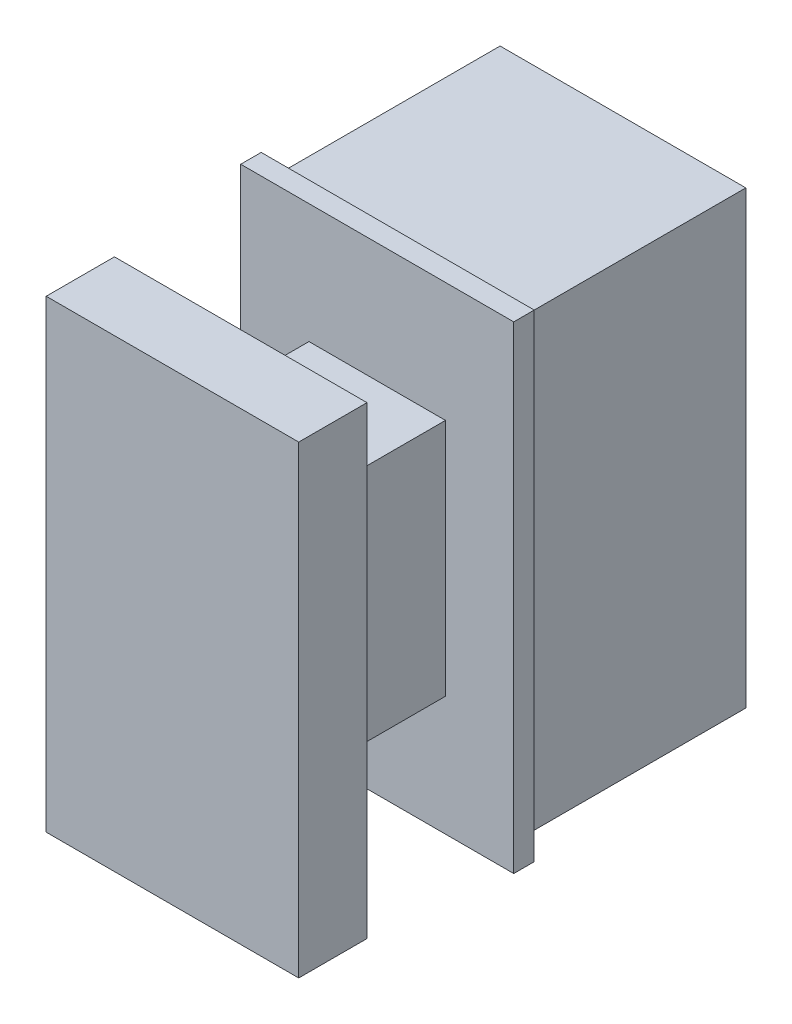
ISO-10303-21;
HEADER;
FILE_DESCRIPTION(('STEP AP214'),'2;1');
FILE_NAME('part.step','',(''),(''),'','','');
FILE_SCHEMA(('AUTOMOTIVE_DESIGN { 1 0 10303 214 1 1 1 1 }'));
ENDSEC;
DATA;
#1=APPLICATION_CONTEXT('core data for automotive mechanical design processes');
#2=APPLICATION_PROTOCOL_DEFINITION('international standard','automotive_design',2000,#1);
#3=PRODUCT_CONTEXT('',#1,'mechanical');
#4=PRODUCT('Part','Part','',(#3));
#5=PRODUCT_RELATED_PRODUCT_CATEGORY('part','',(#4));
#6=PRODUCT_DEFINITION_FORMATION('','',#4);
#7=PRODUCT_DEFINITION_CONTEXT('part definition',#1,'design');
#8=PRODUCT_DEFINITION('design','',#6,#7);
#9=PRODUCT_DEFINITION_SHAPE('','',#8);
#10=(LENGTH_UNIT() NAMED_UNIT(*) SI_UNIT(.MILLI.,.METRE.));
#11=(NAMED_UNIT(*) PLANE_ANGLE_UNIT() SI_UNIT($,.RADIAN.));
#12=(NAMED_UNIT(*) SI_UNIT($,.STERADIAN.) SOLID_ANGLE_UNIT());
#13=UNCERTAINTY_MEASURE_WITH_UNIT(LENGTH_MEASURE(1.E-05),#10,'distance_accuracy_value','');
#14=(GEOMETRIC_REPRESENTATION_CONTEXT(3) GLOBAL_UNCERTAINTY_ASSIGNED_CONTEXT((#13)) GLOBAL_UNIT_ASSIGNED_CONTEXT((#10,
#11,#12)) REPRESENTATION_CONTEXT('',''));
#15=CARTESIAN_POINT('',(0.,0.,0.));
#16=DIRECTION('',(0.,0.,1.));
#17=DIRECTION('',(1.,0.,0.));
#18=AXIS2_PLACEMENT_3D('',#15,#16,#17);
#19=CARTESIAN_POINT('',(0.,0.,0.));
#20=DIRECTION('',(0.,0.,-1.));
#21=DIRECTION('',(-1.,0.,0.));
#22=AXIS2_PLACEMENT_3D('',#19,#20,#21);
#23=PLANE('',#22);
#24=DIRECTION('',(0.,-1.,0.));
#25=VECTOR('',#24,1.);
#26=CARTESIAN_POINT('',(0.,0.,0.));
#27=LINE('',#26,#25);
#28=CARTESIAN_POINT('',(0.,7.,0.));
#29=VERTEX_POINT('',#28);
#30=CARTESIAN_POINT('',(0.,0.,0.));
#31=VERTEX_POINT('',#30);
#32=EDGE_CURVE('E320',#29,#31,#27,.T.);
#33=ORIENTED_EDGE('',*,*,#32,.F.);
#34=DIRECTION('',(-1.,0.,0.));
#35=VECTOR('',#34,1.);
#36=CARTESIAN_POINT('',(0.,7.,0.));
#37=LINE('',#36,#35);
#38=CARTESIAN_POINT('',(4.,7.,0.));
#39=VERTEX_POINT('',#38);
#40=EDGE_CURVE('E335',#39,#29,#37,.T.);
#41=ORIENTED_EDGE('',*,*,#40,.F.);
#42=DIRECTION('',(0.,1.,0.));
#43=VECTOR('',#42,1.);
#44=CARTESIAN_POINT('',(4.,0.,0.));
#45=LINE('',#44,#43);
#46=CARTESIAN_POINT('',(4.,0.,0.));
#47=VERTEX_POINT('',#46);
#48=EDGE_CURVE('E351',#47,#39,#45,.T.);
#49=ORIENTED_EDGE('',*,*,#48,.F.);
#50=DIRECTION('',(1.,0.,0.));
#51=VECTOR('',#50,1.);
#52=CARTESIAN_POINT('',(0.,0.,0.));
#53=LINE('',#52,#51);
#54=EDGE_CURVE('E348',#31,#47,#53,.T.);
#55=ORIENTED_EDGE('',*,*,#54,.F.);
#56=EDGE_LOOP('',(#33,#41,#49,#55));
#57=FACE_BOUND('',#56,.T.);
#58=DIRECTION('',(0.,-1.,0.));
#59=VECTOR('',#58,1.);
#60=CARTESIAN_POINT('',(0.2,6.8,0.));
#61=LINE('',#60,#59);
#62=CARTESIAN_POINT('',(0.2,6.8,0.));
#63=VERTEX_POINT('',#62);
#64=CARTESIAN_POINT('',(0.200000000000001,0.2,0.));
#65=VERTEX_POINT('',#64);
#66=EDGE_CURVE('E292',#63,#65,#61,.T.);
#67=ORIENTED_EDGE('',*,*,#66,.T.);
#68=DIRECTION('',(1.,0.,0.));
#69=VECTOR('',#68,1.);
#70=CARTESIAN_POINT('',(0.200000000000001,0.2,0.));
#71=LINE('',#70,#69);
#72=CARTESIAN_POINT('',(3.8,0.2,0.));
#73=VERTEX_POINT('',#72);
#74=EDGE_CURVE('E278',#65,#73,#71,.T.);
#75=ORIENTED_EDGE('',*,*,#74,.T.);
#76=DIRECTION('',(0.,-1.,0.));
#77=VECTOR('',#76,1.);
#78=CARTESIAN_POINT('',(3.8,6.8,0.));
#79=LINE('',#78,#77);
#80=CARTESIAN_POINT('',(3.8,6.8,0.));
#81=VERTEX_POINT('',#80);
#82=EDGE_CURVE('E306',#81,#73,#79,.T.);
#83=ORIENTED_EDGE('',*,*,#82,.F.);
#84=DIRECTION('',(1.,0.,0.));
#85=VECTOR('',#84,1.);
#86=CARTESIAN_POINT('',(0.2,6.8,0.));
#87=LINE('',#86,#85);
#88=EDGE_CURVE('E310',#63,#81,#87,.T.);
#89=ORIENTED_EDGE('',*,*,#88,.F.);
#90=EDGE_LOOP('',(#67,#75,#83,#89));
#91=FACE_BOUND('',#90,.T.);
#92=ADVANCED_FACE('F43',(#57,#91),#23,.T.);
#93=CARTESIAN_POINT('',(0.,0.,0.3));
#94=DIRECTION('',(1.,0.,0.));
#95=DIRECTION('',(0.,0.,-1.));
#96=AXIS2_PLACEMENT_3D('',#93,#94,#95);
#97=PLANE('',#96);
#98=ORIENTED_EDGE('',*,*,#32,.T.);
#99=DIRECTION('',(0.,0.,-1.));
#100=VECTOR('',#99,1.);
#101=CARTESIAN_POINT('',(0.,0.,0.3));
#102=LINE('',#101,#100);
#103=CARTESIAN_POINT('',(0.,0.,0.3));
#104=VERTEX_POINT('',#103);
#105=EDGE_CURVE('E367',#104,#31,#102,.T.);
#106=ORIENTED_EDGE('',*,*,#105,.F.);
#107=DIRECTION('',(0.,-1.,0.));
#108=VECTOR('',#107,1.);
#109=CARTESIAN_POINT('',(0.,0.,0.3));
#110=LINE('',#109,#108);
#111=CARTESIAN_POINT('',(0.,7.,0.3));
#112=VERTEX_POINT('',#111);
#113=EDGE_CURVE('E330',#112,#104,#110,.T.);
#114=ORIENTED_EDGE('',*,*,#113,.F.);
#115=DIRECTION('',(0.,0.,-1.));
#116=VECTOR('',#115,1.);
#117=CARTESIAN_POINT('',(0.,7.,0.3));
#118=LINE('',#117,#116);
#119=EDGE_CURVE('E344',#112,#29,#118,.T.);
#120=ORIENTED_EDGE('',*,*,#119,.T.);
#121=EDGE_LOOP('',(#98,#106,#114,#120));
#122=FACE_BOUND('',#121,.T.);
#123=ADVANCED_FACE('F45',(#122),#97,.F.);
#124=CARTESIAN_POINT('',(0.,0.,0.3));
#125=DIRECTION('',(0.,1.,0.));
#126=DIRECTION('',(0.,0.,1.));
#127=AXIS2_PLACEMENT_3D('',#124,#125,#126);
#128=PLANE('',#127);
#129=ORIENTED_EDGE('',*,*,#54,.T.);
#130=DIRECTION('',(0.,0.,-1.));
#131=VECTOR('',#130,1.);
#132=CARTESIAN_POINT('',(4.,0.,0.3));
#133=LINE('',#132,#131);
#134=CARTESIAN_POINT('',(4.,0.,0.3));
#135=VERTEX_POINT('',#134);
#136=EDGE_CURVE('E363',#135,#47,#133,.T.);
#137=ORIENTED_EDGE('',*,*,#136,.F.);
#138=DIRECTION('',(1.,0.,0.));
#139=VECTOR('',#138,1.);
#140=CARTESIAN_POINT('',(0.,0.,0.3));
#141=LINE('',#140,#139);
#142=EDGE_CURVE('E334',#104,#135,#141,.T.);
#143=ORIENTED_EDGE('',*,*,#142,.F.);
#144=ORIENTED_EDGE('',*,*,#105,.T.);
#145=EDGE_LOOP('',(#129,#137,#143,#144));
#146=FACE_BOUND('',#145,.T.);
#147=ADVANCED_FACE('F407',(#146),#128,.F.);
#148=CARTESIAN_POINT('',(4.,0.,0.3));
#149=DIRECTION('',(-1.,0.,0.));
#150=DIRECTION('',(0.,0.,1.));
#151=AXIS2_PLACEMENT_3D('',#148,#149,#150);
#152=PLANE('',#151);
#153=ORIENTED_EDGE('',*,*,#48,.T.);
#154=DIRECTION('',(0.,0.,-1.));
#155=VECTOR('',#154,1.);
#156=CARTESIAN_POINT('',(4.,7.,0.3));
#157=LINE('',#156,#155);
#158=CARTESIAN_POINT('',(4.,7.,0.3));
#159=VERTEX_POINT('',#158);
#160=EDGE_CURVE('E359',#159,#39,#157,.T.);
#161=ORIENTED_EDGE('',*,*,#160,.F.);
#162=DIRECTION('',(0.,1.,0.));
#163=VECTOR('',#162,1.);
#164=CARTESIAN_POINT('',(4.,0.,0.3));
#165=LINE('',#164,#163);
#166=EDGE_CURVE('E338',#135,#159,#165,.T.);
#167=ORIENTED_EDGE('',*,*,#166,.F.);
#168=ORIENTED_EDGE('',*,*,#136,.T.);
#169=EDGE_LOOP('',(#153,#161,#167,#168));
#170=FACE_BOUND('',#169,.T.);
#171=ADVANCED_FACE('F412',(#170),#152,.F.);
#172=CARTESIAN_POINT('',(0.,7.,0.3));
#173=DIRECTION('',(0.,-1.,0.));
#174=DIRECTION('',(0.,0.,-1.));
#175=AXIS2_PLACEMENT_3D('',#172,#173,#174);
#176=PLANE('',#175);
#177=ORIENTED_EDGE('',*,*,#40,.T.);
#178=ORIENTED_EDGE('',*,*,#119,.F.);
#179=DIRECTION('',(-1.,0.,0.));
#180=VECTOR('',#179,1.);
#181=CARTESIAN_POINT('',(0.,7.,0.3));
#182=LINE('',#181,#180);
#183=EDGE_CURVE('E341',#159,#112,#182,.T.);
#184=ORIENTED_EDGE('',*,*,#183,.F.);
#185=ORIENTED_EDGE('',*,*,#160,.T.);
#186=EDGE_LOOP('',(#177,#178,#184,#185));
#187=FACE_BOUND('',#186,.T.);
#188=ADVANCED_FACE('F397',(#187),#176,.F.);
#189=CARTESIAN_POINT('',(0.,0.,0.3));
#190=DIRECTION('',(0.,0.,-1.));
#191=DIRECTION('',(-1.,0.,0.));
#192=AXIS2_PLACEMENT_3D('',#189,#190,#191);
#193=PLANE('',#192);
#194=DIRECTION('',(0.,1.,0.));
#195=VECTOR('',#194,1.);
#196=CARTESIAN_POINT('',(1.,0.,0.3));
#197=LINE('',#196,#195);
#198=CARTESIAN_POINT('',(1.,1.75,0.3));
#199=VERTEX_POINT('',#198);
#200=CARTESIAN_POINT('',(1.,5.25,0.3));
#201=VERTEX_POINT('',#200);
#202=EDGE_CURVE('E52',#199,#201,#197,.T.);
#203=ORIENTED_EDGE('',*,*,#202,.T.);
#204=DIRECTION('',(1.,0.,0.));
#205=VECTOR('',#204,1.);
#206=CARTESIAN_POINT('',(0.,5.25,0.3));
#207=LINE('',#206,#205);
#208=CARTESIAN_POINT('',(3.,5.25,0.3));
#209=VERTEX_POINT('',#208);
#210=EDGE_CURVE('E11',#201,#209,#207,.T.);
#211=ORIENTED_EDGE('',*,*,#210,.T.);
#212=DIRECTION('',(0.,1.,0.));
#213=VECTOR('',#212,1.);
#214=CARTESIAN_POINT('',(3.,0.,0.3));
#215=LINE('',#214,#213);
#216=CARTESIAN_POINT('',(3.,1.75,0.3));
#217=VERTEX_POINT('',#216);
#218=EDGE_CURVE('E371',#217,#209,#215,.T.);
#219=ORIENTED_EDGE('',*,*,#218,.F.);
#220=DIRECTION('',(1.,0.,0.));
#221=VECTOR('',#220,1.);
#222=CARTESIAN_POINT('',(0.,1.75,0.3));
#223=LINE('',#222,#221);
#224=EDGE_CURVE('E62',#199,#217,#223,.T.);
#225=ORIENTED_EDGE('',*,*,#224,.F.);
#226=EDGE_LOOP('',(#203,#211,#219,#225));
#227=FACE_BOUND('',#226,.T.);
#228=ORIENTED_EDGE('',*,*,#113,.T.);
#229=ORIENTED_EDGE('',*,*,#142,.T.);
#230=ORIENTED_EDGE('',*,*,#166,.T.);
#231=ORIENTED_EDGE('',*,*,#183,.T.);
#232=EDGE_LOOP('',(#228,#229,#230,#231));
#233=FACE_BOUND('',#232,.T.);
#234=ADVANCED_FACE('F393',(#227,#233),#193,.F.);
#235=CARTESIAN_POINT('',(0.200000000000001,0.2,-3.3));
#236=DIRECTION('',(0.,-1.,0.));
#237=DIRECTION('',(0.,0.,-1.));
#238=AXIS2_PLACEMENT_3D('',#235,#236,#237);
#239=PLANE('',#238);
#240=ORIENTED_EDGE('',*,*,#74,.F.);
#241=DIRECTION('',(0.,0.,1.));
#242=VECTOR('',#241,1.);
#243=CARTESIAN_POINT('',(0.200000000000001,0.2,-3.3));
#244=LINE('',#243,#242);
#245=CARTESIAN_POINT('',(0.200000000000001,0.2,-3.3));
#246=VERTEX_POINT('',#245);
#247=EDGE_CURVE('E316',#246,#65,#244,.T.);
#248=ORIENTED_EDGE('',*,*,#247,.F.);
#249=DIRECTION('',(1.,0.,0.));
#250=VECTOR('',#249,1.);
#251=CARTESIAN_POINT('',(0.200000000000001,0.2,-3.3));
#252=LINE('',#251,#250);
#253=CARTESIAN_POINT('',(3.8,0.2,-3.3));
#254=VERTEX_POINT('',#253);
#255=EDGE_CURVE('E287',#246,#254,#252,.T.);
#256=ORIENTED_EDGE('',*,*,#255,.T.);
#257=DIRECTION('',(0.,0.,1.));
#258=VECTOR('',#257,1.);
#259=CARTESIAN_POINT('',(3.8,0.2,-3.3));
#260=LINE('',#259,#258);
#261=EDGE_CURVE('E302',#254,#73,#260,.T.);
#262=ORIENTED_EDGE('',*,*,#261,.T.);
#263=EDGE_LOOP('',(#240,#248,#256,#262));
#264=FACE_BOUND('',#263,.T.);
#265=ADVANCED_FACE('F396',(#264),#239,.T.);
#266=CARTESIAN_POINT('',(0.2,6.8,-3.3));
#267=DIRECTION('',(-1.,0.,0.));
#268=DIRECTION('',(0.,-1.,0.));
#269=AXIS2_PLACEMENT_3D('',#266,#267,#268);
#270=PLANE('',#269);
#271=ORIENTED_EDGE('',*,*,#66,.F.);
#272=DIRECTION('',(0.,0.,1.));
#273=VECTOR('',#272,1.);
#274=CARTESIAN_POINT('',(0.2,6.8,-3.3));
#275=LINE('',#274,#273);
#276=CARTESIAN_POINT('',(0.2,6.8,-3.3));
#277=VERTEX_POINT('',#276);
#278=EDGE_CURVE('E321',#277,#63,#275,.T.);
#279=ORIENTED_EDGE('',*,*,#278,.F.);
#280=DIRECTION('',(0.,-1.,0.));
#281=VECTOR('',#280,1.);
#282=CARTESIAN_POINT('',(0.2,6.8,-3.3));
#283=LINE('',#282,#281);
#284=EDGE_CURVE('E298',#277,#246,#283,.T.);
#285=ORIENTED_EDGE('',*,*,#284,.T.);
#286=ORIENTED_EDGE('',*,*,#247,.T.);
#287=EDGE_LOOP('',(#271,#279,#285,#286));
#288=FACE_BOUND('',#287,.T.);
#289=ADVANCED_FACE('F423',(#288),#270,.T.);
#290=CARTESIAN_POINT('',(0.2,6.8,-3.3));
#291=DIRECTION('',(0.,-1.,0.));
#292=DIRECTION('',(0.,0.,-1.));
#293=AXIS2_PLACEMENT_3D('',#290,#291,#292);
#294=PLANE('',#293);
#295=ORIENTED_EDGE('',*,*,#88,.T.);
#296=DIRECTION('',(0.,0.,1.));
#297=VECTOR('',#296,1.);
#298=CARTESIAN_POINT('',(3.8,6.8,-3.3));
#299=LINE('',#298,#297);
#300=CARTESIAN_POINT('',(3.8,6.8,-3.3));
#301=VERTEX_POINT('',#300);
#302=EDGE_CURVE('E324',#301,#81,#299,.T.);
#303=ORIENTED_EDGE('',*,*,#302,.F.);
#304=DIRECTION('',(1.,0.,0.));
#305=VECTOR('',#304,1.);
#306=CARTESIAN_POINT('',(0.2,6.8,-3.3));
#307=LINE('',#306,#305);
#308=EDGE_CURVE('E295',#277,#301,#307,.T.);
#309=ORIENTED_EDGE('',*,*,#308,.F.);
#310=ORIENTED_EDGE('',*,*,#278,.T.);
#311=EDGE_LOOP('',(#295,#303,#309,#310));
#312=FACE_BOUND('',#311,.T.);
#313=ADVANCED_FACE('F436',(#312),#294,.F.);
#314=CARTESIAN_POINT('',(3.8,6.8,-3.3));
#315=DIRECTION('',(-1.,0.,0.));
#316=DIRECTION('',(0.,-1.,0.));
#317=AXIS2_PLACEMENT_3D('',#314,#315,#316);
#318=PLANE('',#317);
#319=ORIENTED_EDGE('',*,*,#82,.T.);
#320=ORIENTED_EDGE('',*,*,#261,.F.);
#321=DIRECTION('',(0.,-1.,0.));
#322=VECTOR('',#321,1.);
#323=CARTESIAN_POINT('',(3.8,6.8,-3.3));
#324=LINE('',#323,#322);
#325=EDGE_CURVE('E291',#301,#254,#324,.T.);
#326=ORIENTED_EDGE('',*,*,#325,.F.);
#327=ORIENTED_EDGE('',*,*,#302,.T.);
#328=EDGE_LOOP('',(#319,#320,#326,#327));
#329=FACE_BOUND('',#328,.T.);
#330=ADVANCED_FACE('F434',(#329),#318,.F.);
#331=CARTESIAN_POINT('',(0.,0.,-3.3));
#332=DIRECTION('',(0.,0.,-1.));
#333=DIRECTION('',(-1.,0.,0.));
#334=AXIS2_PLACEMENT_3D('',#331,#332,#333);
#335=PLANE('',#334);
#336=DIRECTION('',(0.,1.,0.));
#337=VECTOR('',#336,1.);
#338=CARTESIAN_POINT('',(3.6,6.6,-3.3));
#339=LINE('',#338,#337);
#340=CARTESIAN_POINT('',(3.6,0.4,-3.3));
#341=VERTEX_POINT('',#340);
#342=CARTESIAN_POINT('',(3.6,6.6,-3.3));
#343=VERTEX_POINT('',#342);
#344=EDGE_CURVE('E243',#341,#343,#339,.T.);
#345=ORIENTED_EDGE('',*,*,#344,.T.);
#346=DIRECTION('',(-1.,0.,0.));
#347=VECTOR('',#346,1.);
#348=CARTESIAN_POINT('',(3.6,6.6,-3.3));
#349=LINE('',#348,#347);
#350=CARTESIAN_POINT('',(0.4,6.6,-3.3));
#351=VERTEX_POINT('',#350);
#352=EDGE_CURVE('E247',#343,#351,#349,.T.);
#353=ORIENTED_EDGE('',*,*,#352,.T.);
#354=DIRECTION('',(0.,-1.,0.));
#355=VECTOR('',#354,1.);
#356=CARTESIAN_POINT('',(0.4,6.6,-3.3));
#357=LINE('',#356,#355);
#358=CARTESIAN_POINT('',(0.400000000000001,0.4,-3.3));
#359=VERTEX_POINT('',#358);
#360=EDGE_CURVE('E252',#351,#359,#357,.T.);
#361=ORIENTED_EDGE('',*,*,#360,.T.);
#362=DIRECTION('',(1.,0.,0.));
#363=VECTOR('',#362,1.);
#364=CARTESIAN_POINT('',(3.6,0.4,-3.3));
#365=LINE('',#364,#363);
#366=EDGE_CURVE('E256',#359,#341,#365,.T.);
#367=ORIENTED_EDGE('',*,*,#366,.T.);
#368=EDGE_LOOP('',(#345,#353,#361,#367));
#369=FACE_BOUND('',#368,.T.);
#370=ORIENTED_EDGE('',*,*,#255,.F.);
#371=ORIENTED_EDGE('',*,*,#284,.F.);
#372=ORIENTED_EDGE('',*,*,#308,.T.);
#373=ORIENTED_EDGE('',*,*,#325,.T.);
#374=EDGE_LOOP('',(#370,#371,#372,#373));
#375=FACE_BOUND('',#374,.T.);
#376=ADVANCED_FACE('F429',(#369,#375),#335,.T.);
#377=CARTESIAN_POINT('',(3.6,6.6,-3.3));
#378=DIRECTION('',(1.,0.,0.));
#379=DIRECTION('',(0.,1.,0.));
#380=AXIS2_PLACEMENT_3D('',#377,#378,#379);
#381=PLANE('',#380);
#382=DIRECTION('',(0.,1.,0.));
#383=VECTOR('',#382,1.);
#384=CARTESIAN_POINT('',(3.6,6.6,0.));
#385=LINE('',#384,#383);
#386=CARTESIAN_POINT('',(3.6,0.4,0.));
#387=VERTEX_POINT('',#386);
#388=CARTESIAN_POINT('',(3.6,6.6,0.));
#389=VERTEX_POINT('',#388);
#390=EDGE_CURVE('E231',#387,#389,#385,.T.);
#391=ORIENTED_EDGE('',*,*,#390,.T.);
#392=DIRECTION('',(0.,0.,1.));
#393=VECTOR('',#392,1.);
#394=CARTESIAN_POINT('',(3.6,6.6,-3.3));
#395=LINE('',#394,#393);
#396=EDGE_CURVE('E260',#343,#389,#395,.T.);
#397=ORIENTED_EDGE('',*,*,#396,.F.);
#398=ORIENTED_EDGE('',*,*,#344,.F.);
#399=DIRECTION('',(0.,0.,1.));
#400=VECTOR('',#399,1.);
#401=CARTESIAN_POINT('',(3.6,0.4,-3.3));
#402=LINE('',#401,#400);
#403=EDGE_CURVE('E275',#341,#387,#402,.T.);
#404=ORIENTED_EDGE('',*,*,#403,.T.);
#405=EDGE_LOOP('',(#391,#397,#398,#404));
#406=FACE_BOUND('',#405,.T.);
#407=ADVANCED_FACE('F502',(#406),#381,.F.);
#408=CARTESIAN_POINT('',(3.6,0.4,-3.3));
#409=DIRECTION('',(0.,-1.,0.));
#410=DIRECTION('',(1.,0.,0.));
#411=AXIS2_PLACEMENT_3D('',#408,#409,#410);
#412=PLANE('',#411);
#413=DIRECTION('',(1.,0.,0.));
#414=VECTOR('',#413,1.);
#415=CARTESIAN_POINT('',(3.6,0.4,0.));
#416=LINE('',#415,#414);
#417=CARTESIAN_POINT('',(0.400000000000001,0.4,0.));
#418=VERTEX_POINT('',#417);
#419=EDGE_CURVE('E248',#418,#387,#416,.T.);
#420=ORIENTED_EDGE('',*,*,#419,.T.);
#421=ORIENTED_EDGE('',*,*,#403,.F.);
#422=ORIENTED_EDGE('',*,*,#366,.F.);
#423=DIRECTION('',(0.,0.,1.));
#424=VECTOR('',#423,1.);
#425=CARTESIAN_POINT('',(0.400000000000001,0.4,-3.3));
#426=LINE('',#425,#424);
#427=EDGE_CURVE('E279',#359,#418,#426,.T.);
#428=ORIENTED_EDGE('',*,*,#427,.T.);
#429=EDGE_LOOP('',(#420,#421,#422,#428));
#430=FACE_BOUND('',#429,.T.);
#431=ADVANCED_FACE('F512',(#430),#412,.F.);
#432=CARTESIAN_POINT('',(0.4,6.6,-3.3));
#433=DIRECTION('',(-1.,0.,0.));
#434=DIRECTION('',(0.,-1.,0.));
#435=AXIS2_PLACEMENT_3D('',#432,#433,#434);
#436=PLANE('',#435);
#437=DIRECTION('',(0.,-1.,0.));
#438=VECTOR('',#437,1.);
#439=CARTESIAN_POINT('',(0.4,6.6,0.));
#440=LINE('',#439,#438);
#441=CARTESIAN_POINT('',(0.4,6.6,0.));
#442=VERTEX_POINT('',#441);
#443=EDGE_CURVE('E268',#442,#418,#440,.T.);
#444=ORIENTED_EDGE('',*,*,#443,.T.);
#445=ORIENTED_EDGE('',*,*,#427,.F.);
#446=ORIENTED_EDGE('',*,*,#360,.F.);
#447=DIRECTION('',(0.,0.,1.));
#448=VECTOR('',#447,1.);
#449=CARTESIAN_POINT('',(0.4,6.6,-3.3));
#450=LINE('',#449,#448);
#451=EDGE_CURVE('E282',#351,#442,#450,.T.);
#452=ORIENTED_EDGE('',*,*,#451,.T.);
#453=EDGE_LOOP('',(#444,#445,#446,#452));
#454=FACE_BOUND('',#453,.T.);
#455=ADVANCED_FACE('F523',(#454),#436,.F.);
#456=CARTESIAN_POINT('',(3.6,6.6,-3.3));
#457=DIRECTION('',(0.,1.,0.));
#458=DIRECTION('',(0.,0.,1.));
#459=AXIS2_PLACEMENT_3D('',#456,#457,#458);
#460=PLANE('',#459);
#461=DIRECTION('',(-1.,0.,0.));
#462=VECTOR('',#461,1.);
#463=CARTESIAN_POINT('',(3.6,6.6,0.));
#464=LINE('',#463,#462);
#465=EDGE_CURVE('E264',#389,#442,#464,.T.);
#466=ORIENTED_EDGE('',*,*,#465,.T.);
#467=ORIENTED_EDGE('',*,*,#451,.F.);
#468=ORIENTED_EDGE('',*,*,#352,.F.);
#469=ORIENTED_EDGE('',*,*,#396,.T.);
#470=EDGE_LOOP('',(#466,#467,#468,#469));
#471=FACE_BOUND('',#470,.T.);
#472=ADVANCED_FACE('F534',(#471),#460,.F.);
#473=CARTESIAN_POINT('',(0.,0.,0.));
#474=DIRECTION('',(0.,0.,-1.));
#475=DIRECTION('',(-1.,0.,0.));
#476=AXIS2_PLACEMENT_3D('',#473,#474,#475);
#477=PLANE('',#476);
#478=ORIENTED_EDGE('',*,*,#390,.F.);
#479=ORIENTED_EDGE('',*,*,#419,.F.);
#480=ORIENTED_EDGE('',*,*,#443,.F.);
#481=ORIENTED_EDGE('',*,*,#465,.F.);
#482=EDGE_LOOP('',(#478,#479,#480,#481));
#483=FACE_BOUND('',#482,.T.);
#484=ADVANCED_FACE('F545',(#483),#477,.T.);
#485=CARTESIAN_POINT('',(1.,5.25,2.3));
#486=DIRECTION('',(0.,1.,0.));
#487=DIRECTION('',(0.,0.,1.));
#488=AXIS2_PLACEMENT_3D('',#485,#486,#487);
#489=PLANE('',#488);
#490=ORIENTED_EDGE('',*,*,#210,.F.);
#491=DIRECTION('',(0.,0.,-1.));
#492=VECTOR('',#491,1.);
#493=CARTESIAN_POINT('',(1.,5.25,2.3));
#494=LINE('',#493,#492);
#495=CARTESIAN_POINT('',(1.,5.25,2.3));
#496=VERTEX_POINT('',#495);
#497=EDGE_CURVE('E227',#496,#201,#494,.T.);
#498=ORIENTED_EDGE('',*,*,#497,.F.);
#499=DIRECTION('',(1.,0.,0.));
#500=VECTOR('',#499,1.);
#501=CARTESIAN_POINT('',(1.,5.25,2.3));
#502=LINE('',#501,#500);
#503=CARTESIAN_POINT('',(3.,5.25,2.3));
#504=VERTEX_POINT('',#503);
#505=EDGE_CURVE('E205',#496,#504,#502,.T.);
#506=ORIENTED_EDGE('',*,*,#505,.T.);
#507=DIRECTION('',(0.,0.,-1.));
#508=VECTOR('',#507,1.);
#509=CARTESIAN_POINT('',(3.,5.25,2.3));
#510=LINE('',#509,#508);
#511=EDGE_CURVE('E226',#504,#209,#510,.T.);
#512=ORIENTED_EDGE('',*,*,#511,.T.);
#513=EDGE_LOOP('',(#490,#498,#506,#512));
#514=FACE_BOUND('',#513,.T.);
#515=ADVANCED_FACE('F392',(#514),#489,.T.);
#516=CARTESIAN_POINT('',(1.,1.75,2.3));
#517=DIRECTION('',(-1.,0.,0.));
#518=DIRECTION('',(0.,0.,1.));
#519=AXIS2_PLACEMENT_3D('',#516,#517,#518);
#520=PLANE('',#519);
#521=ORIENTED_EDGE('',*,*,#202,.F.);
#522=DIRECTION('',(0.,0.,-1.));
#523=VECTOR('',#522,1.);
#524=CARTESIAN_POINT('',(1.,1.75,2.3));
#525=LINE('',#524,#523);
#526=CARTESIAN_POINT('',(1.,1.75,2.3));
#527=VERTEX_POINT('',#526);
#528=EDGE_CURVE('E232',#527,#199,#525,.T.);
#529=ORIENTED_EDGE('',*,*,#528,.F.);
#530=DIRECTION('',(0.,1.,0.));
#531=VECTOR('',#530,1.);
#532=CARTESIAN_POINT('',(1.,1.75,2.3));
#533=LINE('',#532,#531);
#534=EDGE_CURVE('E222',#527,#496,#533,.T.);
#535=ORIENTED_EDGE('',*,*,#534,.T.);
#536=ORIENTED_EDGE('',*,*,#497,.T.);
#537=EDGE_LOOP('',(#521,#529,#535,#536));
#538=FACE_BOUND('',#537,.T.);
#539=ADVANCED_FACE('F390',(#538),#520,.T.);
#540=CARTESIAN_POINT('',(1.,1.75,2.3));
#541=DIRECTION('',(0.,1.,0.));
#542=DIRECTION('',(0.,0.,1.));
#543=AXIS2_PLACEMENT_3D('',#540,#541,#542);
#544=PLANE('',#543);
#545=ORIENTED_EDGE('',*,*,#528,.T.);
#546=ORIENTED_EDGE('',*,*,#224,.T.);
#547=DIRECTION('',(0.,0.,-1.));
#548=VECTOR('',#547,1.);
#549=CARTESIAN_POINT('',(3.,1.75,2.3));
#550=LINE('',#549,#548);
#551=CARTESIAN_POINT('',(3.,1.75,2.3));
#552=VERTEX_POINT('',#551);
#553=EDGE_CURVE('E236',#552,#217,#550,.T.);
#554=ORIENTED_EDGE('',*,*,#553,.F.);
#555=DIRECTION('',(1.,0.,0.));
#556=VECTOR('',#555,1.);
#557=CARTESIAN_POINT('',(1.,1.75,2.3));
#558=LINE('',#557,#556);
#559=EDGE_CURVE('E218',#527,#552,#558,.T.);
#560=ORIENTED_EDGE('',*,*,#559,.F.);
#561=EDGE_LOOP('',(#545,#546,#554,#560));
#562=FACE_BOUND('',#561,.T.);
#563=ADVANCED_FACE('F378',(#562),#544,.F.);
#564=CARTESIAN_POINT('',(3.,1.75,2.3));
#565=DIRECTION('',(-1.,0.,0.));
#566=DIRECTION('',(0.,0.,1.));
#567=AXIS2_PLACEMENT_3D('',#564,#565,#566);
#568=PLANE('',#567);
#569=ORIENTED_EDGE('',*,*,#553,.T.);
#570=ORIENTED_EDGE('',*,*,#218,.T.);
#571=ORIENTED_EDGE('',*,*,#511,.F.);
#572=DIRECTION('',(0.,1.,0.));
#573=VECTOR('',#572,1.);
#574=CARTESIAN_POINT('',(3.,1.75,2.3));
#575=LINE('',#574,#573);
#576=EDGE_CURVE('E209',#552,#504,#575,.T.);
#577=ORIENTED_EDGE('',*,*,#576,.F.);
#578=EDGE_LOOP('',(#569,#570,#571,#577));
#579=FACE_BOUND('',#578,.T.);
#580=ADVANCED_FACE('F382',(#579),#568,.F.);
#581=CARTESIAN_POINT('',(3.85,6.9,3.3));
#582=DIRECTION('',(-1.,0.,0.));
#583=DIRECTION('',(0.,-1.,0.));
#584=AXIS2_PLACEMENT_3D('',#581,#582,#583);
#585=PLANE('',#584);
#586=DIRECTION('',(0.,1.,0.));
#587=VECTOR('',#586,1.);
#588=CARTESIAN_POINT('',(3.85,6.9,2.3));
#589=LINE('',#588,#587);
#590=CARTESIAN_POINT('',(3.85,0.0999999999999998,2.3));
#591=VERTEX_POINT('',#590);
#592=CARTESIAN_POINT('',(3.85,6.9,2.3));
#593=VERTEX_POINT('',#592);
#594=EDGE_CURVE('E203',#591,#593,#589,.T.);
#595=ORIENTED_EDGE('',*,*,#594,.T.);
#596=DIRECTION('',(0.,0.,-1.));
#597=VECTOR('',#596,1.);
#598=CARTESIAN_POINT('',(3.85,6.9,3.3));
#599=LINE('',#598,#597);
#600=CARTESIAN_POINT('',(3.85,6.9,3.3));
#601=VERTEX_POINT('',#600);
#602=EDGE_CURVE('E181',#601,#593,#599,.T.);
#603=ORIENTED_EDGE('',*,*,#602,.F.);
#604=DIRECTION('',(0.,1.,0.));
#605=VECTOR('',#604,1.);
#606=CARTESIAN_POINT('',(3.85,6.9,3.3));
#607=LINE('',#606,#605);
#608=CARTESIAN_POINT('',(3.85,0.0999999999999998,3.3));
#609=VERTEX_POINT('',#608);
#610=EDGE_CURVE('E189',#609,#601,#607,.T.);
#611=ORIENTED_EDGE('',*,*,#610,.F.);
#612=DIRECTION('',(0.,0.,-1.));
#613=VECTOR('',#612,1.);
#614=CARTESIAN_POINT('',(3.85,0.0999999999999998,3.3));
#615=LINE('',#614,#613);
#616=EDGE_CURVE('E683',#609,#591,#615,.T.);
#617=ORIENTED_EDGE('',*,*,#616,.T.);
#618=EDGE_LOOP('',(#595,#603,#611,#617));
#619=FACE_BOUND('',#618,.T.);
#620=ADVANCED_FACE('F201',(#619),#585,.F.);
#621=CARTESIAN_POINT('',(0.15,6.9,3.3));
#622=DIRECTION('',(0.,-1.,0.));
#623=DIRECTION('',(0.,0.,-1.));
#624=AXIS2_PLACEMENT_3D('',#621,#622,#623);
#625=PLANE('',#624);
#626=DIRECTION('',(-1.,0.,0.));
#627=VECTOR('',#626,1.);
#628=CARTESIAN_POINT('',(0.15,6.9,2.3));
#629=LINE('',#628,#627);
#630=CARTESIAN_POINT('',(0.15,6.9,2.3));
#631=VERTEX_POINT('',#630);
#632=EDGE_CURVE('E691',#593,#631,#629,.T.);
#633=ORIENTED_EDGE('',*,*,#632,.T.);
#634=DIRECTION('',(0.,0.,-1.));
#635=VECTOR('',#634,1.);
#636=CARTESIAN_POINT('',(0.15,6.9,3.3));
#637=LINE('',#636,#635);
#638=CARTESIAN_POINT('',(0.15,6.9,3.3));
#639=VERTEX_POINT('',#638);
#640=EDGE_CURVE('E184',#639,#631,#637,.T.);
#641=ORIENTED_EDGE('',*,*,#640,.F.);
#642=DIRECTION('',(-1.,0.,0.));
#643=VECTOR('',#642,1.);
#644=CARTESIAN_POINT('',(0.15,6.9,3.3));
#645=LINE('',#644,#643);
#646=EDGE_CURVE('E177',#601,#639,#645,.T.);
#647=ORIENTED_EDGE('',*,*,#646,.F.);
#648=ORIENTED_EDGE('',*,*,#602,.T.);
#649=EDGE_LOOP('',(#633,#641,#647,#648));
#650=FACE_BOUND('',#649,.T.);
#651=ADVANCED_FACE('F179',(#650),#625,.F.);
#652=CARTESIAN_POINT('',(0.15,6.9,3.3));
#653=DIRECTION('',(1.,0.,0.));
#654=DIRECTION('',(0.,1.,0.));
#655=AXIS2_PLACEMENT_3D('',#652,#653,#654);
#656=PLANE('',#655);
#657=DIRECTION('',(0.,-1.,0.));
#658=VECTOR('',#657,1.);
#659=CARTESIAN_POINT('',(0.15,6.9,2.3));
#660=LINE('',#659,#658);
#661=CARTESIAN_POINT('',(0.15,0.0999999999999998,2.3));
#662=VERTEX_POINT('',#661);
#663=EDGE_CURVE('E687',#631,#662,#660,.T.);
#664=ORIENTED_EDGE('',*,*,#663,.T.);
#665=DIRECTION('',(0.,0.,-1.));
#666=VECTOR('',#665,1.);
#667=CARTESIAN_POINT('',(0.15,0.0999999999999998,3.3));
#668=LINE('',#667,#666);
#669=CARTESIAN_POINT('',(0.15,0.0999999999999998,3.3));
#670=VERTEX_POINT('',#669);
#671=EDGE_CURVE('E211',#670,#662,#668,.T.);
#672=ORIENTED_EDGE('',*,*,#671,.F.);
#673=DIRECTION('',(0.,-1.,0.));
#674=VECTOR('',#673,1.);
#675=CARTESIAN_POINT('',(0.15,6.9,3.3));
#676=LINE('',#675,#674);
#677=EDGE_CURVE('E188',#639,#670,#676,.T.);
#678=ORIENTED_EDGE('',*,*,#677,.F.);
#679=ORIENTED_EDGE('',*,*,#640,.T.);
#680=EDGE_LOOP('',(#664,#672,#678,#679));
#681=FACE_BOUND('',#680,.T.);
#682=ADVANCED_FACE('F617',(#681),#656,.F.);
#683=CARTESIAN_POINT('',(0.15,0.0999999999999998,3.3));
#684=DIRECTION('',(0.,1.,0.));
#685=DIRECTION('',(0.,0.,1.));
#686=AXIS2_PLACEMENT_3D('',#683,#684,#685);
#687=PLANE('',#686);
#688=DIRECTION('',(1.,0.,0.));
#689=VECTOR('',#688,1.);
#690=CARTESIAN_POINT('',(0.15,0.0999999999999998,2.3));
#691=LINE('',#690,#689);
#692=EDGE_CURVE('E199',#662,#591,#691,.T.);
#693=ORIENTED_EDGE('',*,*,#692,.T.);
#694=ORIENTED_EDGE('',*,*,#616,.F.);
#695=DIRECTION('',(1.,0.,0.));
#696=VECTOR('',#695,1.);
#697=CARTESIAN_POINT('',(0.15,0.0999999999999998,3.3));
#698=LINE('',#697,#696);
#699=EDGE_CURVE('E194',#670,#609,#698,.T.);
#700=ORIENTED_EDGE('',*,*,#699,.F.);
#701=ORIENTED_EDGE('',*,*,#671,.T.);
#702=EDGE_LOOP('',(#693,#694,#700,#701));
#703=FACE_BOUND('',#702,.T.);
#704=ADVANCED_FACE('F627',(#703),#687,.F.);
#705=CARTESIAN_POINT('',(0.,0.,3.3));
#706=DIRECTION('',(0.,0.,1.));
#707=DIRECTION('',(1.,0.,0.));
#708=AXIS2_PLACEMENT_3D('',#705,#706,#707);
#709=PLANE('',#708);
#710=ORIENTED_EDGE('',*,*,#610,.T.);
#711=ORIENTED_EDGE('',*,*,#646,.T.);
#712=ORIENTED_EDGE('',*,*,#677,.T.);
#713=ORIENTED_EDGE('',*,*,#699,.T.);
#714=EDGE_LOOP('',(#710,#711,#712,#713));
#715=FACE_BOUND('',#714,.T.);
#716=ADVANCED_FACE('F192',(#715),#709,.T.);
#717=CARTESIAN_POINT('',(0.,0.,2.3));
#718=DIRECTION('',(0.,0.,1.));
#719=DIRECTION('',(1.,0.,0.));
#720=AXIS2_PLACEMENT_3D('',#717,#718,#719);
#721=PLANE('',#720);
#722=ORIENTED_EDGE('',*,*,#505,.F.);
#723=ORIENTED_EDGE('',*,*,#534,.F.);
#724=ORIENTED_EDGE('',*,*,#559,.T.);
#725=ORIENTED_EDGE('',*,*,#576,.T.);
#726=EDGE_LOOP('',(#722,#723,#724,#725));
#727=FACE_BOUND('',#726,.T.);
#728=ORIENTED_EDGE('',*,*,#594,.F.);
#729=ORIENTED_EDGE('',*,*,#692,.F.);
#730=ORIENTED_EDGE('',*,*,#663,.F.);
#731=ORIENTED_EDGE('',*,*,#632,.F.);
#732=EDGE_LOOP('',(#728,#729,#730,#731));
#733=FACE_BOUND('',#732,.T.);
#734=ADVANCED_FACE('F387',(#727,#733),#721,.F.);
#735=CLOSED_SHELL('',(#92,#123,#147,#171,#188,#234,#265,#289,#313,#330,#376,#407,#431,#455,#472,
#484,#515,#539,#563,#580,#620,#651,#682,#704,#716,#734));
#736=MANIFOLD_SOLID_BREP('B2',#735);
#737=ADVANCED_BREP_SHAPE_REPRESENTATION('',(#18,#736),#14);
#738=SHAPE_DEFINITION_REPRESENTATION(#9,#737);
ENDSEC;
END-ISO-10303-21;
